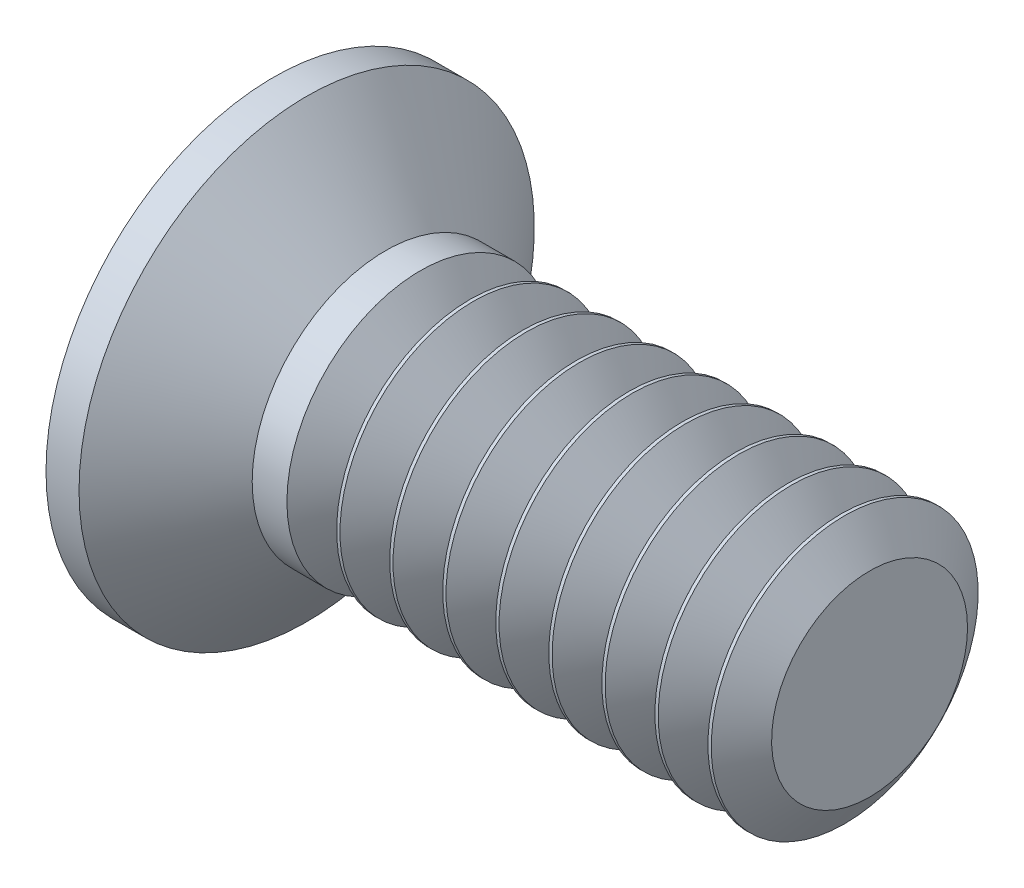
ISO-10303-21;
HEADER;
FILE_DESCRIPTION(('STEP AP214'),'2;1');
FILE_NAME('part.step','',(''),(''),'','','');
FILE_SCHEMA(('AUTOMOTIVE_DESIGN { 1 0 10303 214 1 1 1 1 }'));
ENDSEC;
DATA;
#1=APPLICATION_CONTEXT('core data for automotive mechanical design processes');
#2=APPLICATION_PROTOCOL_DEFINITION('international standard','automotive_design',2000,#1);
#3=PRODUCT_CONTEXT('',#1,'mechanical');
#4=PRODUCT('Part','Part','',(#3));
#5=PRODUCT_RELATED_PRODUCT_CATEGORY('part','',(#4));
#6=PRODUCT_DEFINITION_FORMATION('','',#4);
#7=PRODUCT_DEFINITION_CONTEXT('part definition',#1,'design');
#8=PRODUCT_DEFINITION('design','',#6,#7);
#9=PRODUCT_DEFINITION_SHAPE('','',#8);
#10=(LENGTH_UNIT() NAMED_UNIT(*) SI_UNIT(.MILLI.,.METRE.));
#11=(NAMED_UNIT(*) PLANE_ANGLE_UNIT() SI_UNIT($,.RADIAN.));
#12=(NAMED_UNIT(*) SI_UNIT($,.STERADIAN.) SOLID_ANGLE_UNIT());
#13=UNCERTAINTY_MEASURE_WITH_UNIT(LENGTH_MEASURE(1.E-05),#10,'distance_accuracy_value','');
#14=(GEOMETRIC_REPRESENTATION_CONTEXT(3) GLOBAL_UNCERTAINTY_ASSIGNED_CONTEXT((#13)) GLOBAL_UNIT_ASSIGNED_CONTEXT((#10,
#11,#12)) REPRESENTATION_CONTEXT('',''));
#15=CARTESIAN_POINT('',(0.,0.,0.));
#16=DIRECTION('',(0.,0.,1.));
#17=DIRECTION('',(1.,0.,0.));
#18=AXIS2_PLACEMENT_3D('',#15,#16,#17);
#19=CARTESIAN_POINT('',(0.,0.,0.));
#20=DIRECTION('',(-1.,0.,0.));
#21=DIRECTION('',(0.,0.,1.));
#22=AXIS2_PLACEMENT_3D('',#19,#20,#21);
#23=PLANE('',#22);
#24=CARTESIAN_POINT('',(0.,0.,0.));
#25=DIRECTION('',(-1.,0.,0.));
#26=DIRECTION('',(0.,0.,1.));
#27=AXIS2_PLACEMENT_3D('',#24,#25,#26);
#28=CIRCLE('',#27,2.4257);
#29=CARTESIAN_POINT('',(0.,0.,2.4257));
#30=VERTEX_POINT('',#29);
#31=EDGE_CURVE('E146',#30,#30,#28,.T.);
#32=ORIENTED_EDGE('',*,*,#31,.T.);
#33=EDGE_LOOP('',(#32));
#34=FACE_BOUND('',#33,.T.);
#35=DIRECTION('',(0.,1.,0.));
#36=VECTOR('',#35,1.);
#37=CARTESIAN_POINT('',(0.,-1.7272,-0.368299999999999));
#38=LINE('',#37,#36);
#39=CARTESIAN_POINT('',(0.,-1.7272,-0.368299999999999));
#40=VERTEX_POINT('',#39);
#41=CARTESIAN_POINT('',(0.,-0.368299999999999,-0.368299999999999));
#42=VERTEX_POINT('',#41);
#43=EDGE_CURVE('E114',#40,#42,#38,.T.);
#44=ORIENTED_EDGE('',*,*,#43,.T.);
#45=DIRECTION('',(0.,0.,-1.));
#46=VECTOR('',#45,1.);
#47=CARTESIAN_POINT('',(0.,-0.368300000000006,1.7272));
#48=LINE('',#47,#46);
#49=CARTESIAN_POINT('',(0.,-0.368299999999994,-1.7272));
#50=VERTEX_POINT('',#49);
#51=EDGE_CURVE('E93',#42,#50,#48,.T.);
#52=ORIENTED_EDGE('',*,*,#51,.T.);
#53=DIRECTION('',(0.,1.,0.));
#54=VECTOR('',#53,1.);
#55=CARTESIAN_POINT('',(0.,-0.368299999999994,-1.7272));
#56=LINE('',#55,#54);
#57=CARTESIAN_POINT('',(0.,0.368300000000005,-1.7272));
#58=VERTEX_POINT('',#57);
#59=EDGE_CURVE('E245',#50,#58,#56,.T.);
#60=ORIENTED_EDGE('',*,*,#59,.T.);
#61=DIRECTION('',(0.,0.,1.));
#62=VECTOR('',#61,1.);
#63=CARTESIAN_POINT('',(0.,0.368300000000005,-1.7272));
#64=LINE('',#63,#62);
#65=CARTESIAN_POINT('',(0.,0.3683,-0.368299999999999));
#66=VERTEX_POINT('',#65);
#67=EDGE_CURVE('E109',#58,#66,#64,.T.);
#68=ORIENTED_EDGE('',*,*,#67,.T.);
#69=CARTESIAN_POINT('',(0.,1.7272,-0.368299999999999));
#70=VERTEX_POINT('',#69);
#71=EDGE_CURVE('E103',#66,#70,#38,.T.);
#72=ORIENTED_EDGE('',*,*,#71,.T.);
#73=DIRECTION('',(0.,0.,1.));
#74=VECTOR('',#73,1.);
#75=CARTESIAN_POINT('',(0.,1.7272,-0.368299999999999));
#76=LINE('',#75,#74);
#77=CARTESIAN_POINT('',(0.,1.7272,0.3683));
#78=VERTEX_POINT('',#77);
#79=EDGE_CURVE('E106',#70,#78,#76,.T.);
#80=ORIENTED_EDGE('',*,*,#79,.T.);
#81=DIRECTION('',(0.,-1.,0.));
#82=VECTOR('',#81,1.);
#83=CARTESIAN_POINT('',(0.,1.7272,0.3683));
#84=LINE('',#83,#82);
#85=CARTESIAN_POINT('',(0.,0.368299999999998,0.3683));
#86=VERTEX_POINT('',#85);
#87=EDGE_CURVE('E233',#78,#86,#84,.T.);
#88=ORIENTED_EDGE('',*,*,#87,.T.);
#89=CARTESIAN_POINT('',(0.,0.368299999999993,1.7272));
#90=VERTEX_POINT('',#89);
#91=EDGE_CURVE('E259',#86,#90,#64,.T.);
#92=ORIENTED_EDGE('',*,*,#91,.T.);
#93=DIRECTION('',(0.,-1.,0.));
#94=VECTOR('',#93,1.);
#95=CARTESIAN_POINT('',(0.,0.368299999999993,1.7272));
#96=LINE('',#95,#94);
#97=CARTESIAN_POINT('',(0.,-0.368300000000006,1.7272));
#98=VERTEX_POINT('',#97);
#99=EDGE_CURVE('E262',#90,#98,#96,.T.);
#100=ORIENTED_EDGE('',*,*,#99,.T.);
#101=CARTESIAN_POINT('',(0.,-0.368300000000001,0.3683));
#102=VERTEX_POINT('',#101);
#103=EDGE_CURVE('E265',#98,#102,#48,.T.);
#104=ORIENTED_EDGE('',*,*,#103,.T.);
#105=CARTESIAN_POINT('',(0.,-1.7272,0.3683));
#106=VERTEX_POINT('',#105);
#107=EDGE_CURVE('E121',#102,#106,#84,.T.);
#108=ORIENTED_EDGE('',*,*,#107,.T.);
#109=DIRECTION('',(0.,0.,-1.));
#110=VECTOR('',#109,1.);
#111=CARTESIAN_POINT('',(0.,-1.7272,0.3683));
#112=LINE('',#111,#110);
#113=EDGE_CURVE('E151',#106,#40,#112,.T.);
#114=ORIENTED_EDGE('',*,*,#113,.T.);
#115=EDGE_LOOP('',(#44,#52,#60,#68,#72,#80,#88,#92,#100,#104,#108,#114));
#116=FACE_BOUND('',#115,.T.);
#117=ADVANCED_FACE('F43',(#34,#116),#23,.T.);
#118=CARTESIAN_POINT('',(2.53038353909465,0.,0.162173251028807));
#119=DIRECTION('',(-0.0811917318550204,0.,-0.996698501392664));
#120=DIRECTION('',(-0.996698501392664,0.,0.0811917318550204));
#121=AXIS2_PLACEMENT_3D('',#118,#119,#120);
#122=PLANE('',#121);
#123=ORIENTED_EDGE('',*,*,#107,.F.);
#124=DIRECTION('',(0.993429488023182,0.0809254358221134,-0.0809254358221131));
#125=VECTOR('',#124,1.);
#126=CARTESIAN_POINT('',(2.5434212491012,-0.161111190382206,0.161111190382205));
#127=LINE('',#126,#125);
#128=CARTESIAN_POINT('',(2.2606,-0.184150000000001,0.184149999999999));
#129=VERTEX_POINT('',#128);
#130=EDGE_CURVE('E145',#102,#129,#127,.T.);
#131=ORIENTED_EDGE('',*,*,#130,.T.);
#132=DIRECTION('',(0.824069658417724,0.562496985942435,-0.0671292699272865));
#133=VECTOR('',#132,1.);
#134=CARTESIAN_POINT('',(0.,-1.7272,0.3683));
#135=LINE('',#134,#133);
#136=EDGE_CURVE('E115',#106,#129,#135,.T.);
#137=ORIENTED_EDGE('',*,*,#136,.F.);
#138=EDGE_LOOP('',(#123,#131,#137));
#139=FACE_BOUND('',#138,.T.);
#140=ADVANCED_FACE('F188',(#139),#122,.T.);
#141=DIRECTION('',(0.824069658417724,-0.562496985942435,-0.0671292699272865));
#142=VECTOR('',#141,1.);
#143=CARTESIAN_POINT('',(0.,1.7272,0.3683));
#144=LINE('',#143,#142);
#145=CARTESIAN_POINT('',(2.2606,0.18415,0.18415));
#146=VERTEX_POINT('',#145);
#147=EDGE_CURVE('E59',#78,#146,#144,.T.);
#148=ORIENTED_EDGE('',*,*,#147,.T.);
#149=DIRECTION('',(-0.993429488023182,0.0809254358221125,0.0809254358221131));
#150=VECTOR('',#149,1.);
#151=CARTESIAN_POINT('',(2.5434212491012,0.161111190382205,0.161111190382205));
#152=LINE('',#151,#150);
#153=EDGE_CURVE('E239',#146,#86,#152,.T.);
#154=ORIENTED_EDGE('',*,*,#153,.T.);
#155=ORIENTED_EDGE('',*,*,#87,.F.);
#156=EDGE_LOOP('',(#148,#154,#155));
#157=FACE_BOUND('',#156,.T.);
#158=ADVANCED_FACE('F195',(#157),#122,.T.);
#159=CARTESIAN_POINT('',(2.53038353909465,0.,-0.162173251028807));
#160=DIRECTION('',(-0.08119173185502,0.,0.996698501392664));
#161=DIRECTION('',(0.996698501392664,0.,0.08119173185502));
#162=AXIS2_PLACEMENT_3D('',#159,#160,#161);
#163=PLANE('',#162);
#164=DIRECTION('',(0.824069658417724,0.562496985942435,0.0671292699272863));
#165=VECTOR('',#164,1.);
#166=CARTESIAN_POINT('',(0.,-1.7272,-0.368299999999999));
#167=LINE('',#166,#165);
#168=CARTESIAN_POINT('',(2.2606,-0.184149999999999,-0.184150000000001));
#169=VERTEX_POINT('',#168);
#170=EDGE_CURVE('E68',#40,#169,#167,.T.);
#171=ORIENTED_EDGE('',*,*,#170,.T.);
#172=DIRECTION('',(-0.993429488023182,-0.0809254358221129,-0.0809254358221128));
#173=VECTOR('',#172,1.);
#174=CARTESIAN_POINT('',(2.5434212491012,-0.161111190382205,-0.161111190382206));
#175=LINE('',#174,#173);
#176=EDGE_CURVE('E11',#169,#42,#175,.T.);
#177=ORIENTED_EDGE('',*,*,#176,.T.);
#178=ORIENTED_EDGE('',*,*,#43,.F.);
#179=EDGE_LOOP('',(#171,#177,#178));
#180=FACE_BOUND('',#179,.T.);
#181=ADVANCED_FACE('F174',(#180),#163,.T.);
#182=ORIENTED_EDGE('',*,*,#71,.F.);
#183=DIRECTION('',(0.993429488023182,-0.0809254358221131,0.0809254358221128));
#184=VECTOR('',#183,1.);
#185=CARTESIAN_POINT('',(2.5434212491012,0.161111190382206,-0.161111190382205));
#186=LINE('',#185,#184);
#187=CARTESIAN_POINT('',(2.2606,0.18415,-0.18415));
#188=VERTEX_POINT('',#187);
#189=EDGE_CURVE('E124',#66,#188,#186,.T.);
#190=ORIENTED_EDGE('',*,*,#189,.T.);
#191=DIRECTION('',(0.824069658417724,-0.562496985942435,0.0671292699272862));
#192=VECTOR('',#191,1.);
#193=CARTESIAN_POINT('',(0.,1.7272,-0.368299999999999));
#194=LINE('',#193,#192);
#195=EDGE_CURVE('E119',#70,#188,#194,.T.);
#196=ORIENTED_EDGE('',*,*,#195,.F.);
#197=EDGE_LOOP('',(#182,#190,#196));
#198=FACE_BOUND('',#197,.T.);
#199=ADVANCED_FACE('F123',(#198),#163,.T.);
#200=CARTESIAN_POINT('',(-6.34999999999999,0.,0.));
#201=DIRECTION('',(-1.,0.,0.));
#202=DIRECTION('',(0.,0.,1.));
#203=AXIS2_PLACEMENT_3D('',#200,#201,#202);
#204=CYLINDRICAL_SURFACE('',#203,1.4224);
#205=CARTESIAN_POINT('',(1.56382485508915,0.,0.));
#206=DIRECTION('',(-1.,0.,0.));
#207=DIRECTION('',(0.,-1.,0.));
#208=AXIS2_PLACEMENT_3D('',#205,#206,#207);
#209=CIRCLE('',#208,1.4224);
#210=CARTESIAN_POINT('',(1.56382485508915,-1.4224,0.));
#211=VERTEX_POINT('',#210);
#212=EDGE_CURVE('E275',#211,#211,#209,.T.);
#213=ORIENTED_EDGE('',*,*,#212,.T.);
#214=EDGE_LOOP('',(#213));
#215=FACE_BOUND('',#214,.T.);
#216=CARTESIAN_POINT('',(1.1938,0.,0.));
#217=DIRECTION('',(-1.,0.,0.));
#218=DIRECTION('',(0.,0.,1.));
#219=AXIS2_PLACEMENT_3D('',#216,#217,#218);
#220=CIRCLE('',#219,1.4224);
#221=CARTESIAN_POINT('',(1.1938,0.,1.4224));
#222=VERTEX_POINT('',#221);
#223=EDGE_CURVE('E52',#222,#222,#220,.T.);
#224=ORIENTED_EDGE('',*,*,#223,.F.);
#225=EDGE_LOOP('',(#224));
#226=FACE_BOUND('',#225,.T.);
#227=ADVANCED_FACE('F161',(#215,#226),#204,.T.);
#228=CARTESIAN_POINT('',(0.35193134003984,0.,0.));
#229=DIRECTION('',(-1.,0.,0.));
#230=DIRECTION('',(0.,0.,1.));
#231=AXIS2_PLACEMENT_3D('',#228,#229,#230);
#232=CONICAL_SURFACE('',#231,2.4257,0.872664625997167);
#233=ORIENTED_EDGE('',*,*,#223,.T.);
#234=EDGE_LOOP('',(#233));
#235=FACE_BOUND('',#234,.T.);
#236=CARTESIAN_POINT('',(0.35193134003984,0.,0.));
#237=DIRECTION('',(-1.,0.,0.));
#238=DIRECTION('',(0.,0.,1.));
#239=AXIS2_PLACEMENT_3D('',#236,#237,#238);
#240=CIRCLE('',#239,2.4257);
#241=CARTESIAN_POINT('',(0.35193134003984,0.,2.4257));
#242=VERTEX_POINT('',#241);
#243=EDGE_CURVE('E150',#242,#242,#240,.T.);
#244=ORIENTED_EDGE('',*,*,#243,.F.);
#245=EDGE_LOOP('',(#244));
#246=FACE_BOUND('',#245,.T.);
#247=ADVANCED_FACE('F158',(#235,#246),#232,.T.);
#248=CARTESIAN_POINT('',(-6.34999999999999,0.,0.));
#249=DIRECTION('',(-1.,0.,0.));
#250=DIRECTION('',(0.,0.,1.));
#251=AXIS2_PLACEMENT_3D('',#248,#249,#250);
#252=CYLINDRICAL_SURFACE('',#251,2.4257);
#253=ORIENTED_EDGE('',*,*,#243,.T.);
#254=EDGE_LOOP('',(#253));
#255=FACE_BOUND('',#254,.T.);
#256=ORIENTED_EDGE('',*,*,#31,.F.);
#257=EDGE_LOOP('',(#256));
#258=FACE_BOUND('',#257,.T.);
#259=ADVANCED_FACE('F171',(#255,#258),#252,.T.);
#260=CARTESIAN_POINT('',(2.2606,0.18415,-0.18415));
#261=DIRECTION('',(1.,0.,0.));
#262=DIRECTION('',(0.,0.,-1.));
#263=AXIS2_PLACEMENT_3D('',#260,#261,#262);
#264=PLANE('',#263);
#265=DIRECTION('',(0.,1.,0.));
#266=VECTOR('',#265,1.);
#267=CARTESIAN_POINT('',(2.2606,-0.18415,-0.18415));
#268=LINE('',#267,#266);
#269=EDGE_CURVE('E139',#169,#188,#268,.T.);
#270=ORIENTED_EDGE('',*,*,#269,.F.);
#271=DIRECTION('',(0.,0.,-1.));
#272=VECTOR('',#271,1.);
#273=CARTESIAN_POINT('',(2.2606,-0.18415,0.18415));
#274=LINE('',#273,#272);
#275=EDGE_CURVE('E127',#129,#169,#274,.T.);
#276=ORIENTED_EDGE('',*,*,#275,.F.);
#277=DIRECTION('',(0.,-1.,0.));
#278=VECTOR('',#277,1.);
#279=CARTESIAN_POINT('',(2.2606,0.18415,0.18415));
#280=LINE('',#279,#278);
#281=EDGE_CURVE('E132',#146,#129,#280,.T.);
#282=ORIENTED_EDGE('',*,*,#281,.F.);
#283=DIRECTION('',(0.,0.,1.));
#284=VECTOR('',#283,1.);
#285=CARTESIAN_POINT('',(2.2606,0.18415,-0.18415));
#286=LINE('',#285,#284);
#287=EDGE_CURVE('E136',#188,#146,#286,.T.);
#288=ORIENTED_EDGE('',*,*,#287,.F.);
#289=EDGE_LOOP('',(#270,#276,#282,#288));
#290=FACE_BOUND('',#289,.T.);
#291=ADVANCED_FACE('F200',(#290),#264,.F.);
#292=CARTESIAN_POINT('',(2.2606,-0.18415,-0.18415));
#293=DIRECTION('',(-0.563768686614846,0.825932726069486,0.));
#294=DIRECTION('',(-0.825932726069486,-0.563768686614846,0.));
#295=AXIS2_PLACEMENT_3D('',#292,#293,#294);
#296=PLANE('',#295);
#297=ORIENTED_EDGE('',*,*,#170,.F.);
#298=ORIENTED_EDGE('',*,*,#113,.F.);
#299=ORIENTED_EDGE('',*,*,#136,.T.);
#300=ORIENTED_EDGE('',*,*,#275,.T.);
#301=EDGE_LOOP('',(#297,#298,#299,#300));
#302=FACE_BOUND('',#301,.T.);
#303=ADVANCED_FACE('F206',(#302),#296,.T.);
#304=CARTESIAN_POINT('',(0.,1.7272,0.3683));
#305=DIRECTION('',(-0.563768686614846,-0.825932726069486,0.));
#306=DIRECTION('',(0.825932726069486,-0.563768686614846,0.));
#307=AXIS2_PLACEMENT_3D('',#304,#305,#306);
#308=PLANE('',#307);
#309=ORIENTED_EDGE('',*,*,#147,.F.);
#310=ORIENTED_EDGE('',*,*,#79,.F.);
#311=ORIENTED_EDGE('',*,*,#195,.T.);
#312=ORIENTED_EDGE('',*,*,#287,.T.);
#313=EDGE_LOOP('',(#309,#310,#311,#312));
#314=FACE_BOUND('',#313,.T.);
#315=ADVANCED_FACE('F118',(#314),#308,.T.);
#316=CARTESIAN_POINT('',(2.53038353909465,-0.162173251028807,0.));
#317=DIRECTION('',(-0.0811917318550204,0.996698501392664,0.));
#318=DIRECTION('',(-0.996698501392664,-0.0811917318550204,0.));
#319=AXIS2_PLACEMENT_3D('',#316,#317,#318);
#320=PLANE('',#319);
#321=DIRECTION('',(0.824069658417724,0.0671292699272846,0.562496985942436));
#322=VECTOR('',#321,1.);
#323=CARTESIAN_POINT('',(0.,-0.368299999999994,-1.7272));
#324=LINE('',#323,#322);
#325=EDGE_CURVE('E256',#50,#169,#324,.T.);
#326=ORIENTED_EDGE('',*,*,#325,.F.);
#327=ORIENTED_EDGE('',*,*,#51,.F.);
#328=ORIENTED_EDGE('',*,*,#176,.F.);
#329=EDGE_LOOP('',(#326,#327,#328));
#330=FACE_BOUND('',#329,.T.);
#331=ADVANCED_FACE('F454',(#330),#320,.T.);
#332=CARTESIAN_POINT('',(2.53038353909465,0.162173251028807,0.));
#333=DIRECTION('',(-0.08119173185502,-0.996698501392664,0.));
#334=DIRECTION('',(0.996698501392664,-0.08119173185502,0.));
#335=AXIS2_PLACEMENT_3D('',#332,#333,#334);
#336=PLANE('',#335);
#337=ORIENTED_EDGE('',*,*,#67,.F.);
#338=DIRECTION('',(0.824069658417724,-0.0671292699272882,0.562496985942435));
#339=VECTOR('',#338,1.);
#340=CARTESIAN_POINT('',(0.,0.368300000000005,-1.7272));
#341=LINE('',#340,#339);
#342=EDGE_CURVE('E84',#58,#188,#341,.T.);
#343=ORIENTED_EDGE('',*,*,#342,.T.);
#344=ORIENTED_EDGE('',*,*,#189,.F.);
#345=EDGE_LOOP('',(#337,#343,#344));
#346=FACE_BOUND('',#345,.T.);
#347=ADVANCED_FACE('F453',(#346),#336,.T.);
#348=CARTESIAN_POINT('',(2.2606,0.184150000000001,-0.184149999999999));
#349=DIRECTION('',(-0.563768686614846,0.,0.825932726069486));
#350=DIRECTION('',(-0.825932726069486,0.,-0.563768686614846));
#351=AXIS2_PLACEMENT_3D('',#348,#349,#350);
#352=PLANE('',#351);
#353=ORIENTED_EDGE('',*,*,#342,.F.);
#354=ORIENTED_EDGE('',*,*,#59,.F.);
#355=ORIENTED_EDGE('',*,*,#325,.T.);
#356=ORIENTED_EDGE('',*,*,#269,.T.);
#357=EDGE_LOOP('',(#353,#354,#355,#356));
#358=FACE_BOUND('',#357,.T.);
#359=ADVANCED_FACE('F449',(#358),#352,.T.);
#360=ORIENTED_EDGE('',*,*,#103,.F.);
#361=DIRECTION('',(0.824069658417724,0.0671292699272884,-0.562496985942435));
#362=VECTOR('',#361,1.);
#363=CARTESIAN_POINT('',(0.,-0.368300000000006,1.7272));
#364=LINE('',#363,#362);
#365=EDGE_CURVE('E249',#98,#129,#364,.T.);
#366=ORIENTED_EDGE('',*,*,#365,.T.);
#367=ORIENTED_EDGE('',*,*,#130,.F.);
#368=EDGE_LOOP('',(#360,#366,#367));
#369=FACE_BOUND('',#368,.T.);
#370=ADVANCED_FACE('F452',(#369),#320,.T.);
#371=DIRECTION('',(0.824069658417724,-0.0671292699272843,-0.562496985942436));
#372=VECTOR('',#371,1.);
#373=CARTESIAN_POINT('',(0.,0.368299999999993,1.7272));
#374=LINE('',#373,#372);
#375=EDGE_CURVE('E246',#90,#146,#374,.T.);
#376=ORIENTED_EDGE('',*,*,#375,.F.);
#377=ORIENTED_EDGE('',*,*,#91,.F.);
#378=ORIENTED_EDGE('',*,*,#153,.F.);
#379=EDGE_LOOP('',(#376,#377,#378));
#380=FACE_BOUND('',#379,.T.);
#381=ADVANCED_FACE('F459',(#380),#336,.T.);
#382=CARTESIAN_POINT('',(0.,-0.368300000000006,1.7272));
#383=DIRECTION('',(-0.563768686614846,0.,-0.825932726069486));
#384=DIRECTION('',(0.825932726069486,0.,-0.563768686614846));
#385=AXIS2_PLACEMENT_3D('',#382,#383,#384);
#386=PLANE('',#385);
#387=ORIENTED_EDGE('',*,*,#365,.F.);
#388=ORIENTED_EDGE('',*,*,#99,.F.);
#389=ORIENTED_EDGE('',*,*,#375,.T.);
#390=ORIENTED_EDGE('',*,*,#281,.T.);
#391=EDGE_LOOP('',(#387,#388,#389,#390));
#392=FACE_BOUND('',#391,.T.);
#393=ADVANCED_FACE('F447',(#392),#386,.T.);
#394=CARTESIAN_POINT('',(2.09382594491085,0.,0.));
#395=DIRECTION('',(1.,0.,0.));
#396=DIRECTION('',(0.,1.,0.));
#397=AXIS2_PLACEMENT_3D('',#394,#395,#396);
#398=CONICAL_SURFACE('',#397,1.4224,0.959931088596883);
#399=CARTESIAN_POINT('',(1.8288254,0.,0.));
#400=DIRECTION('',(-1.,0.,0.));
#401=DIRECTION('',(0.,-1.,0.));
#402=AXIS2_PLACEMENT_3D('',#399,#400,#401);
#403=CIRCLE('',#402,1.04394);
#404=CARTESIAN_POINT('',(1.8288254,-1.04394,0.));
#405=VERTEX_POINT('',#404);
#406=EDGE_CURVE('E278',#405,#405,#403,.T.);
#407=ORIENTED_EDGE('',*,*,#406,.F.);
#408=EDGE_LOOP('',(#407));
#409=FACE_BOUND('',#408,.T.);
#410=CARTESIAN_POINT('',(2.09382594491085,0.,0.));
#411=DIRECTION('',(-1.,0.,0.));
#412=DIRECTION('',(0.,-1.,0.));
#413=AXIS2_PLACEMENT_3D('',#410,#411,#412);
#414=CIRCLE('',#413,1.4224);
#415=CARTESIAN_POINT('',(2.09382594491085,-1.4224,0.));
#416=VERTEX_POINT('',#415);
#417=EDGE_CURVE('E250',#416,#416,#414,.T.);
#418=ORIENTED_EDGE('',*,*,#417,.T.);
#419=EDGE_LOOP('',(#418));
#420=FACE_BOUND('',#419,.T.);
#421=ADVANCED_FACE('F444',(#409,#420),#398,.T.);
#422=CARTESIAN_POINT('',(1.8288254,0.,0.));
#423=DIRECTION('',(-1.,0.,0.));
#424=DIRECTION('',(0.,-1.,0.));
#425=AXIS2_PLACEMENT_3D('',#422,#423,#424);
#426=CONICAL_SURFACE('',#425,1.04394,0.959931088596876);
#427=ORIENTED_EDGE('',*,*,#212,.F.);
#428=EDGE_LOOP('',(#427));
#429=FACE_BOUND('',#428,.T.);
#430=ORIENTED_EDGE('',*,*,#406,.T.);
#431=EDGE_LOOP('',(#430));
#432=FACE_BOUND('',#431,.T.);
#433=ADVANCED_FACE('F184',(#429,#432),#426,.T.);
#434=CARTESIAN_POINT('',(2.12897485508915,0.,0.));
#435=DIRECTION('',(-1.,0.,0.));
#436=DIRECTION('',(0.,-1.,0.));
#437=AXIS2_PLACEMENT_3D('',#434,#435,#436);
#438=CIRCLE('',#437,1.4224);
#439=CARTESIAN_POINT('',(2.12897485508915,-1.4224,0.));
#440=VERTEX_POINT('',#439);
#441=EDGE_CURVE('E286',#440,#440,#438,.T.);
#442=ORIENTED_EDGE('',*,*,#441,.T.);
#443=EDGE_LOOP('',(#442));
#444=FACE_BOUND('',#443,.T.);
#445=ORIENTED_EDGE('',*,*,#417,.F.);
#446=EDGE_LOOP('',(#445));
#447=FACE_BOUND('',#446,.T.);
#448=ADVANCED_FACE('F165',(#444,#447),#204,.T.);
#449=CARTESIAN_POINT('',(2.65897594491085,0.,0.));
#450=DIRECTION('',(1.,0.,0.));
#451=DIRECTION('',(0.,1.,0.));
#452=AXIS2_PLACEMENT_3D('',#449,#450,#451);
#453=CONICAL_SURFACE('',#452,1.4224,0.959931088596883);
#454=CARTESIAN_POINT('',(2.3939754,0.,0.));
#455=DIRECTION('',(-1.,0.,0.));
#456=DIRECTION('',(0.,-1.,0.));
#457=AXIS2_PLACEMENT_3D('',#454,#455,#456);
#458=CIRCLE('',#457,1.04394);
#459=CARTESIAN_POINT('',(2.3939754,-1.04394,0.));
#460=VERTEX_POINT('',#459);
#461=EDGE_CURVE('E290',#460,#460,#458,.T.);
#462=ORIENTED_EDGE('',*,*,#461,.F.);
#463=EDGE_LOOP('',(#462));
#464=FACE_BOUND('',#463,.T.);
#465=CARTESIAN_POINT('',(2.65897594491085,0.,0.));
#466=DIRECTION('',(-1.,0.,0.));
#467=DIRECTION('',(0.,-1.,0.));
#468=AXIS2_PLACEMENT_3D('',#465,#466,#467);
#469=CIRCLE('',#468,1.4224);
#470=CARTESIAN_POINT('',(2.65897594491085,-1.4224,0.));
#471=VERTEX_POINT('',#470);
#472=EDGE_CURVE('E282',#471,#471,#469,.T.);
#473=ORIENTED_EDGE('',*,*,#472,.T.);
#474=EDGE_LOOP('',(#473));
#475=FACE_BOUND('',#474,.T.);
#476=ADVANCED_FACE('F183',(#464,#475),#453,.T.);
#477=CARTESIAN_POINT('',(2.3939754,0.,0.));
#478=DIRECTION('',(-1.,0.,0.));
#479=DIRECTION('',(0.,-1.,0.));
#480=AXIS2_PLACEMENT_3D('',#477,#478,#479);
#481=CONICAL_SURFACE('',#480,1.04394,0.959931088596876);
#482=ORIENTED_EDGE('',*,*,#441,.F.);
#483=EDGE_LOOP('',(#482));
#484=FACE_BOUND('',#483,.T.);
#485=ORIENTED_EDGE('',*,*,#461,.T.);
#486=EDGE_LOOP('',(#485));
#487=FACE_BOUND('',#486,.T.);
#488=ADVANCED_FACE('F435',(#484,#487),#481,.T.);
#489=CARTESIAN_POINT('',(2.69412485508915,0.,0.));
#490=DIRECTION('',(-1.,0.,0.));
#491=DIRECTION('',(0.,-1.,0.));
#492=AXIS2_PLACEMENT_3D('',#489,#490,#491);
#493=CIRCLE('',#492,1.4224);
#494=CARTESIAN_POINT('',(2.69412485508915,-1.4224,0.));
#495=VERTEX_POINT('',#494);
#496=EDGE_CURVE('E298',#495,#495,#493,.T.);
#497=ORIENTED_EDGE('',*,*,#496,.T.);
#498=EDGE_LOOP('',(#497));
#499=FACE_BOUND('',#498,.T.);
#500=ORIENTED_EDGE('',*,*,#472,.F.);
#501=EDGE_LOOP('',(#500));
#502=FACE_BOUND('',#501,.T.);
#503=ADVANCED_FACE('F186',(#499,#502),#204,.T.);
#504=CARTESIAN_POINT('',(3.22412594491085,0.,0.));
#505=DIRECTION('',(1.,0.,0.));
#506=DIRECTION('',(0.,1.,0.));
#507=AXIS2_PLACEMENT_3D('',#504,#505,#506);
#508=CONICAL_SURFACE('',#507,1.4224,0.959931088596883);
#509=CARTESIAN_POINT('',(2.9591254,0.,0.));
#510=DIRECTION('',(-1.,0.,0.));
#511=DIRECTION('',(0.,-1.,0.));
#512=AXIS2_PLACEMENT_3D('',#509,#510,#511);
#513=CIRCLE('',#512,1.04394);
#514=CARTESIAN_POINT('',(2.9591254,-1.04394,0.));
#515=VERTEX_POINT('',#514);
#516=EDGE_CURVE('E302',#515,#515,#513,.T.);
#517=ORIENTED_EDGE('',*,*,#516,.F.);
#518=EDGE_LOOP('',(#517));
#519=FACE_BOUND('',#518,.T.);
#520=CARTESIAN_POINT('',(3.22412594491085,0.,0.));
#521=DIRECTION('',(-1.,0.,0.));
#522=DIRECTION('',(0.,-1.,0.));
#523=AXIS2_PLACEMENT_3D('',#520,#521,#522);
#524=CIRCLE('',#523,1.4224);
#525=CARTESIAN_POINT('',(3.22412594491085,-1.4224,0.));
#526=VERTEX_POINT('',#525);
#527=EDGE_CURVE('E294',#526,#526,#524,.T.);
#528=ORIENTED_EDGE('',*,*,#527,.T.);
#529=EDGE_LOOP('',(#528));
#530=FACE_BOUND('',#529,.T.);
#531=ADVANCED_FACE('F430',(#519,#530),#508,.T.);
#532=CARTESIAN_POINT('',(2.9591254,0.,0.));
#533=DIRECTION('',(-1.,0.,0.));
#534=DIRECTION('',(0.,-1.,0.));
#535=AXIS2_PLACEMENT_3D('',#532,#533,#534);
#536=CONICAL_SURFACE('',#535,1.04394,0.959931088596876);
#537=ORIENTED_EDGE('',*,*,#496,.F.);
#538=EDGE_LOOP('',(#537));
#539=FACE_BOUND('',#538,.T.);
#540=ORIENTED_EDGE('',*,*,#516,.T.);
#541=EDGE_LOOP('',(#540));
#542=FACE_BOUND('',#541,.T.);
#543=ADVANCED_FACE('F427',(#539,#542),#536,.T.);
#544=CARTESIAN_POINT('',(3.25927485508915,0.,0.));
#545=DIRECTION('',(-1.,0.,0.));
#546=DIRECTION('',(0.,-1.,0.));
#547=AXIS2_PLACEMENT_3D('',#544,#545,#546);
#548=CIRCLE('',#547,1.4224);
#549=CARTESIAN_POINT('',(3.25927485508915,-1.4224,0.));
#550=VERTEX_POINT('',#549);
#551=EDGE_CURVE('E310',#550,#550,#548,.T.);
#552=ORIENTED_EDGE('',*,*,#551,.T.);
#553=EDGE_LOOP('',(#552));
#554=FACE_BOUND('',#553,.T.);
#555=ORIENTED_EDGE('',*,*,#527,.F.);
#556=EDGE_LOOP('',(#555));
#557=FACE_BOUND('',#556,.T.);
#558=ADVANCED_FACE('F425',(#554,#557),#204,.T.);
#559=CARTESIAN_POINT('',(3.78927594491085,0.,0.));
#560=DIRECTION('',(1.,0.,0.));
#561=DIRECTION('',(0.,1.,0.));
#562=AXIS2_PLACEMENT_3D('',#559,#560,#561);
#563=CONICAL_SURFACE('',#562,1.4224,0.959931088596883);
#564=CARTESIAN_POINT('',(3.5242754,0.,0.));
#565=DIRECTION('',(-1.,0.,0.));
#566=DIRECTION('',(0.,-1.,0.));
#567=AXIS2_PLACEMENT_3D('',#564,#565,#566);
#568=CIRCLE('',#567,1.04394);
#569=CARTESIAN_POINT('',(3.5242754,-1.04394,0.));
#570=VERTEX_POINT('',#569);
#571=EDGE_CURVE('E314',#570,#570,#568,.T.);
#572=ORIENTED_EDGE('',*,*,#571,.F.);
#573=EDGE_LOOP('',(#572));
#574=FACE_BOUND('',#573,.T.);
#575=CARTESIAN_POINT('',(3.78927594491085,0.,0.));
#576=DIRECTION('',(-1.,0.,0.));
#577=DIRECTION('',(0.,-1.,0.));
#578=AXIS2_PLACEMENT_3D('',#575,#576,#577);
#579=CIRCLE('',#578,1.4224);
#580=CARTESIAN_POINT('',(3.78927594491085,-1.4224,0.));
#581=VERTEX_POINT('',#580);
#582=EDGE_CURVE('E306',#581,#581,#579,.T.);
#583=ORIENTED_EDGE('',*,*,#582,.T.);
#584=EDGE_LOOP('',(#583));
#585=FACE_BOUND('',#584,.T.);
#586=ADVANCED_FACE('F421',(#574,#585),#563,.T.);
#587=CARTESIAN_POINT('',(3.5242754,0.,0.));
#588=DIRECTION('',(-1.,0.,0.));
#589=DIRECTION('',(0.,-1.,0.));
#590=AXIS2_PLACEMENT_3D('',#587,#588,#589);
#591=CONICAL_SURFACE('',#590,1.04394,0.959931088596876);
#592=ORIENTED_EDGE('',*,*,#551,.F.);
#593=EDGE_LOOP('',(#592));
#594=FACE_BOUND('',#593,.T.);
#595=ORIENTED_EDGE('',*,*,#571,.T.);
#596=EDGE_LOOP('',(#595));
#597=FACE_BOUND('',#596,.T.);
#598=ADVANCED_FACE('F418',(#594,#597),#591,.T.);
#599=CARTESIAN_POINT('',(3.82442485508915,0.,0.));
#600=DIRECTION('',(-1.,0.,0.));
#601=DIRECTION('',(0.,-1.,0.));
#602=AXIS2_PLACEMENT_3D('',#599,#600,#601);
#603=CIRCLE('',#602,1.4224);
#604=CARTESIAN_POINT('',(3.82442485508915,-1.4224,0.));
#605=VERTEX_POINT('',#604);
#606=EDGE_CURVE('E322',#605,#605,#603,.T.);
#607=ORIENTED_EDGE('',*,*,#606,.T.);
#608=EDGE_LOOP('',(#607));
#609=FACE_BOUND('',#608,.T.);
#610=ORIENTED_EDGE('',*,*,#582,.F.);
#611=EDGE_LOOP('',(#610));
#612=FACE_BOUND('',#611,.T.);
#613=ADVANCED_FACE('F416',(#609,#612),#204,.T.);
#614=CARTESIAN_POINT('',(4.35442594491085,0.,0.));
#615=DIRECTION('',(1.,0.,0.));
#616=DIRECTION('',(0.,1.,0.));
#617=AXIS2_PLACEMENT_3D('',#614,#615,#616);
#618=CONICAL_SURFACE('',#617,1.4224,0.959931088596883);
#619=CARTESIAN_POINT('',(4.0894254,0.,0.));
#620=DIRECTION('',(-1.,0.,0.));
#621=DIRECTION('',(0.,-1.,0.));
#622=AXIS2_PLACEMENT_3D('',#619,#620,#621);
#623=CIRCLE('',#622,1.04394);
#624=CARTESIAN_POINT('',(4.0894254,-1.04394,0.));
#625=VERTEX_POINT('',#624);
#626=EDGE_CURVE('E326',#625,#625,#623,.T.);
#627=ORIENTED_EDGE('',*,*,#626,.F.);
#628=EDGE_LOOP('',(#627));
#629=FACE_BOUND('',#628,.T.);
#630=CARTESIAN_POINT('',(4.35442594491085,0.,0.));
#631=DIRECTION('',(-1.,0.,0.));
#632=DIRECTION('',(0.,-1.,0.));
#633=AXIS2_PLACEMENT_3D('',#630,#631,#632);
#634=CIRCLE('',#633,1.4224);
#635=CARTESIAN_POINT('',(4.35442594491085,-1.4224,0.));
#636=VERTEX_POINT('',#635);
#637=EDGE_CURVE('E318',#636,#636,#634,.T.);
#638=ORIENTED_EDGE('',*,*,#637,.T.);
#639=EDGE_LOOP('',(#638));
#640=FACE_BOUND('',#639,.T.);
#641=ADVANCED_FACE('F412',(#629,#640),#618,.T.);
#642=CARTESIAN_POINT('',(4.0894254,0.,0.));
#643=DIRECTION('',(-1.,0.,0.));
#644=DIRECTION('',(0.,-1.,0.));
#645=AXIS2_PLACEMENT_3D('',#642,#643,#644);
#646=CONICAL_SURFACE('',#645,1.04394,0.959931088596876);
#647=ORIENTED_EDGE('',*,*,#606,.F.);
#648=EDGE_LOOP('',(#647));
#649=FACE_BOUND('',#648,.T.);
#650=ORIENTED_EDGE('',*,*,#626,.T.);
#651=EDGE_LOOP('',(#650));
#652=FACE_BOUND('',#651,.T.);
#653=ADVANCED_FACE('F409',(#649,#652),#646,.T.);
#654=CARTESIAN_POINT('',(4.38957485508915,0.,0.));
#655=DIRECTION('',(-1.,0.,0.));
#656=DIRECTION('',(0.,-1.,0.));
#657=AXIS2_PLACEMENT_3D('',#654,#655,#656);
#658=CIRCLE('',#657,1.4224);
#659=CARTESIAN_POINT('',(4.38957485508915,-1.4224,0.));
#660=VERTEX_POINT('',#659);
#661=EDGE_CURVE('E334',#660,#660,#658,.T.);
#662=ORIENTED_EDGE('',*,*,#661,.T.);
#663=EDGE_LOOP('',(#662));
#664=FACE_BOUND('',#663,.T.);
#665=ORIENTED_EDGE('',*,*,#637,.F.);
#666=EDGE_LOOP('',(#665));
#667=FACE_BOUND('',#666,.T.);
#668=ADVANCED_FACE('F407',(#664,#667),#204,.T.);
#669=CARTESIAN_POINT('',(4.91957594491085,0.,0.));
#670=DIRECTION('',(1.,0.,0.));
#671=DIRECTION('',(0.,1.,0.));
#672=AXIS2_PLACEMENT_3D('',#669,#670,#671);
#673=CONICAL_SURFACE('',#672,1.4224,0.959931088596883);
#674=CARTESIAN_POINT('',(4.6545754,0.,0.));
#675=DIRECTION('',(-1.,0.,0.));
#676=DIRECTION('',(0.,-1.,0.));
#677=AXIS2_PLACEMENT_3D('',#674,#675,#676);
#678=CIRCLE('',#677,1.04394);
#679=CARTESIAN_POINT('',(4.6545754,-1.04394,0.));
#680=VERTEX_POINT('',#679);
#681=EDGE_CURVE('E338',#680,#680,#678,.T.);
#682=ORIENTED_EDGE('',*,*,#681,.F.);
#683=EDGE_LOOP('',(#682));
#684=FACE_BOUND('',#683,.T.);
#685=CARTESIAN_POINT('',(4.91957594491085,0.,0.));
#686=DIRECTION('',(-1.,0.,0.));
#687=DIRECTION('',(0.,-1.,0.));
#688=AXIS2_PLACEMENT_3D('',#685,#686,#687);
#689=CIRCLE('',#688,1.4224);
#690=CARTESIAN_POINT('',(4.91957594491085,-1.4224,0.));
#691=VERTEX_POINT('',#690);
#692=EDGE_CURVE('E330',#691,#691,#689,.T.);
#693=ORIENTED_EDGE('',*,*,#692,.T.);
#694=EDGE_LOOP('',(#693));
#695=FACE_BOUND('',#694,.T.);
#696=ADVANCED_FACE('F403',(#684,#695),#673,.T.);
#697=CARTESIAN_POINT('',(4.6545754,0.,0.));
#698=DIRECTION('',(-1.,0.,0.));
#699=DIRECTION('',(0.,-1.,0.));
#700=AXIS2_PLACEMENT_3D('',#697,#698,#699);
#701=CONICAL_SURFACE('',#700,1.04394,0.959931088596876);
#702=ORIENTED_EDGE('',*,*,#661,.F.);
#703=EDGE_LOOP('',(#702));
#704=FACE_BOUND('',#703,.T.);
#705=ORIENTED_EDGE('',*,*,#681,.T.);
#706=EDGE_LOOP('',(#705));
#707=FACE_BOUND('',#706,.T.);
#708=ADVANCED_FACE('F400',(#704,#707),#701,.T.);
#709=CARTESIAN_POINT('',(4.95472485508915,0.,0.));
#710=DIRECTION('',(-1.,0.,0.));
#711=DIRECTION('',(0.,-1.,0.));
#712=AXIS2_PLACEMENT_3D('',#709,#710,#711);
#713=CIRCLE('',#712,1.4224);
#714=CARTESIAN_POINT('',(4.95472485508915,-1.4224,0.));
#715=VERTEX_POINT('',#714);
#716=EDGE_CURVE('E346',#715,#715,#713,.T.);
#717=ORIENTED_EDGE('',*,*,#716,.T.);
#718=EDGE_LOOP('',(#717));
#719=FACE_BOUND('',#718,.T.);
#720=ORIENTED_EDGE('',*,*,#692,.F.);
#721=EDGE_LOOP('',(#720));
#722=FACE_BOUND('',#721,.T.);
#723=ADVANCED_FACE('F398',(#719,#722),#204,.T.);
#724=CARTESIAN_POINT('',(5.48472594491085,0.,0.));
#725=DIRECTION('',(1.,0.,0.));
#726=DIRECTION('',(0.,1.,0.));
#727=AXIS2_PLACEMENT_3D('',#724,#725,#726);
#728=CONICAL_SURFACE('',#727,1.4224,0.959931088596883);
#729=CARTESIAN_POINT('',(5.2197254,0.,0.));
#730=DIRECTION('',(-1.,0.,0.));
#731=DIRECTION('',(0.,-1.,0.));
#732=AXIS2_PLACEMENT_3D('',#729,#730,#731);
#733=CIRCLE('',#732,1.04394);
#734=CARTESIAN_POINT('',(5.2197254,-1.04394,0.));
#735=VERTEX_POINT('',#734);
#736=EDGE_CURVE('E350',#735,#735,#733,.T.);
#737=ORIENTED_EDGE('',*,*,#736,.F.);
#738=EDGE_LOOP('',(#737));
#739=FACE_BOUND('',#738,.T.);
#740=CARTESIAN_POINT('',(5.48472594491085,0.,0.));
#741=DIRECTION('',(-1.,0.,0.));
#742=DIRECTION('',(0.,-1.,0.));
#743=AXIS2_PLACEMENT_3D('',#740,#741,#742);
#744=CIRCLE('',#743,1.4224);
#745=CARTESIAN_POINT('',(5.48472594491085,-1.4224,0.));
#746=VERTEX_POINT('',#745);
#747=EDGE_CURVE('E342',#746,#746,#744,.T.);
#748=ORIENTED_EDGE('',*,*,#747,.T.);
#749=EDGE_LOOP('',(#748));
#750=FACE_BOUND('',#749,.T.);
#751=ADVANCED_FACE('F394',(#739,#750),#728,.T.);
#752=CARTESIAN_POINT('',(5.2197254,0.,0.));
#753=DIRECTION('',(-1.,0.,0.));
#754=DIRECTION('',(0.,-1.,0.));
#755=AXIS2_PLACEMENT_3D('',#752,#753,#754);
#756=CONICAL_SURFACE('',#755,1.04394,0.959931088596876);
#757=ORIENTED_EDGE('',*,*,#716,.F.);
#758=EDGE_LOOP('',(#757));
#759=FACE_BOUND('',#758,.T.);
#760=ORIENTED_EDGE('',*,*,#736,.T.);
#761=EDGE_LOOP('',(#760));
#762=FACE_BOUND('',#761,.T.);
#763=ADVANCED_FACE('F391',(#759,#762),#756,.T.);
#764=CARTESIAN_POINT('',(5.51987485508915,0.,0.));
#765=DIRECTION('',(-1.,0.,0.));
#766=DIRECTION('',(0.,-1.,0.));
#767=AXIS2_PLACEMENT_3D('',#764,#765,#766);
#768=CIRCLE('',#767,1.4224);
#769=CARTESIAN_POINT('',(5.51987485508915,-1.4224,0.));
#770=VERTEX_POINT('',#769);
#771=EDGE_CURVE('E358',#770,#770,#768,.T.);
#772=ORIENTED_EDGE('',*,*,#771,.T.);
#773=EDGE_LOOP('',(#772));
#774=FACE_BOUND('',#773,.T.);
#775=ORIENTED_EDGE('',*,*,#747,.F.);
#776=EDGE_LOOP('',(#775));
#777=FACE_BOUND('',#776,.T.);
#778=ADVANCED_FACE('F181',(#774,#777),#204,.T.);
#779=CARTESIAN_POINT('',(6.04987594491085,0.,0.));
#780=DIRECTION('',(1.,0.,0.));
#781=DIRECTION('',(0.,1.,0.));
#782=AXIS2_PLACEMENT_3D('',#779,#780,#781);
#783=CONICAL_SURFACE('',#782,1.4224,0.959931088596883);
#784=CARTESIAN_POINT('',(5.7848754,0.,0.));
#785=DIRECTION('',(-1.,0.,0.));
#786=DIRECTION('',(0.,-1.,0.));
#787=AXIS2_PLACEMENT_3D('',#784,#785,#786);
#788=CIRCLE('',#787,1.04394);
#789=CARTESIAN_POINT('',(5.7848754,-1.04394,0.));
#790=VERTEX_POINT('',#789);
#791=EDGE_CURVE('E362',#790,#790,#788,.T.);
#792=ORIENTED_EDGE('',*,*,#791,.F.);
#793=EDGE_LOOP('',(#792));
#794=FACE_BOUND('',#793,.T.);
#795=CARTESIAN_POINT('',(6.04987594491085,0.,0.));
#796=DIRECTION('',(-1.,0.,0.));
#797=DIRECTION('',(0.,-1.,0.));
#798=AXIS2_PLACEMENT_3D('',#795,#796,#797);
#799=CIRCLE('',#798,1.4224);
#800=CARTESIAN_POINT('',(6.04987594491085,-1.4224,0.));
#801=VERTEX_POINT('',#800);
#802=EDGE_CURVE('E354',#801,#801,#799,.T.);
#803=ORIENTED_EDGE('',*,*,#802,.T.);
#804=EDGE_LOOP('',(#803));
#805=FACE_BOUND('',#804,.T.);
#806=ADVANCED_FACE('F386',(#794,#805),#783,.T.);
#807=CARTESIAN_POINT('',(5.7848754,0.,0.));
#808=DIRECTION('',(-1.,0.,0.));
#809=DIRECTION('',(0.,-1.,0.));
#810=AXIS2_PLACEMENT_3D('',#807,#808,#809);
#811=CONICAL_SURFACE('',#810,1.04394,0.959931088596876);
#812=ORIENTED_EDGE('',*,*,#771,.F.);
#813=EDGE_LOOP('',(#812));
#814=FACE_BOUND('',#813,.T.);
#815=ORIENTED_EDGE('',*,*,#791,.T.);
#816=EDGE_LOOP('',(#815));
#817=FACE_BOUND('',#816,.T.);
#818=ADVANCED_FACE('F179',(#814,#817),#811,.T.);
#819=CARTESIAN_POINT('',(6.08502485508915,0.,0.));
#820=DIRECTION('',(-1.,0.,0.));
#821=DIRECTION('',(0.,-1.,0.));
#822=AXIS2_PLACEMENT_3D('',#819,#820,#821);
#823=CIRCLE('',#822,1.4224);
#824=CARTESIAN_POINT('',(6.08502485508915,-1.4224,0.));
#825=VERTEX_POINT('',#824);
#826=EDGE_CURVE('E370',#825,#825,#823,.T.);
#827=ORIENTED_EDGE('',*,*,#826,.T.);
#828=EDGE_LOOP('',(#827));
#829=FACE_BOUND('',#828,.T.);
#830=ORIENTED_EDGE('',*,*,#802,.F.);
#831=EDGE_LOOP('',(#830));
#832=FACE_BOUND('',#831,.T.);
#833=ADVANCED_FACE('F164',(#829,#832),#204,.T.);
#834=CARTESIAN_POINT('',(6.3500254,0.,0.));
#835=DIRECTION('',(-1.,0.,0.));
#836=DIRECTION('',(0.,-1.,0.));
#837=AXIS2_PLACEMENT_3D('',#834,#835,#836);
#838=CONICAL_SURFACE('',#837,1.04394,0.959931088596876);
#839=CARTESIAN_POINT('',(6.35,0.,0.));
#840=DIRECTION('',(1.,0.,0.));
#841=DIRECTION('',(0.,0.,-1.));
#842=AXIS2_PLACEMENT_3D('',#839,#840,#841);
#843=CIRCLE('',#842,1.04397627495937);
#844=CARTESIAN_POINT('',(6.35,0.,-1.04397627495937));
#845=VERTEX_POINT('',#844);
#846=EDGE_CURVE('E366',#845,#845,#843,.F.);
#847=ORIENTED_EDGE('',*,*,#846,.T.);
#848=EDGE_LOOP('',(#847));
#849=FACE_BOUND('',#848,.T.);
#850=ORIENTED_EDGE('',*,*,#826,.F.);
#851=EDGE_LOOP('',(#850));
#852=FACE_BOUND('',#851,.T.);
#853=ADVANCED_FACE('F178',(#849,#852),#838,.T.);
#854=CARTESIAN_POINT('',(6.35,1.4224,0.));
#855=DIRECTION('',(1.,0.,0.));
#856=DIRECTION('',(0.,0.,-1.));
#857=AXIS2_PLACEMENT_3D('',#854,#855,#856);
#858=PLANE('',#857);
#859=ORIENTED_EDGE('',*,*,#846,.F.);
#860=EDGE_LOOP('',(#859));
#861=FACE_BOUND('',#860,.T.);
#862=ADVANCED_FACE('F45',(#861),#858,.T.);
#863=CLOSED_SHELL('',(#117,#140,#158,#181,#199,#227,#247,#259,#291,#303,#315,#331,#347,#359,
#370,#381,#393,#421,#433,#448,#476,#488,#503,#531,#543,#558,#586,#598,#613,#641,#653,#668,#696,
#708,#723,#751,#763,#778,#806,#818,#833,#853,#862));
#864=MANIFOLD_SOLID_BREP('B2',#863);
#865=ADVANCED_BREP_SHAPE_REPRESENTATION('',(#18,#864),#14);
#866=SHAPE_DEFINITION_REPRESENTATION(#9,#865);
ENDSEC;
END-ISO-10303-21;
